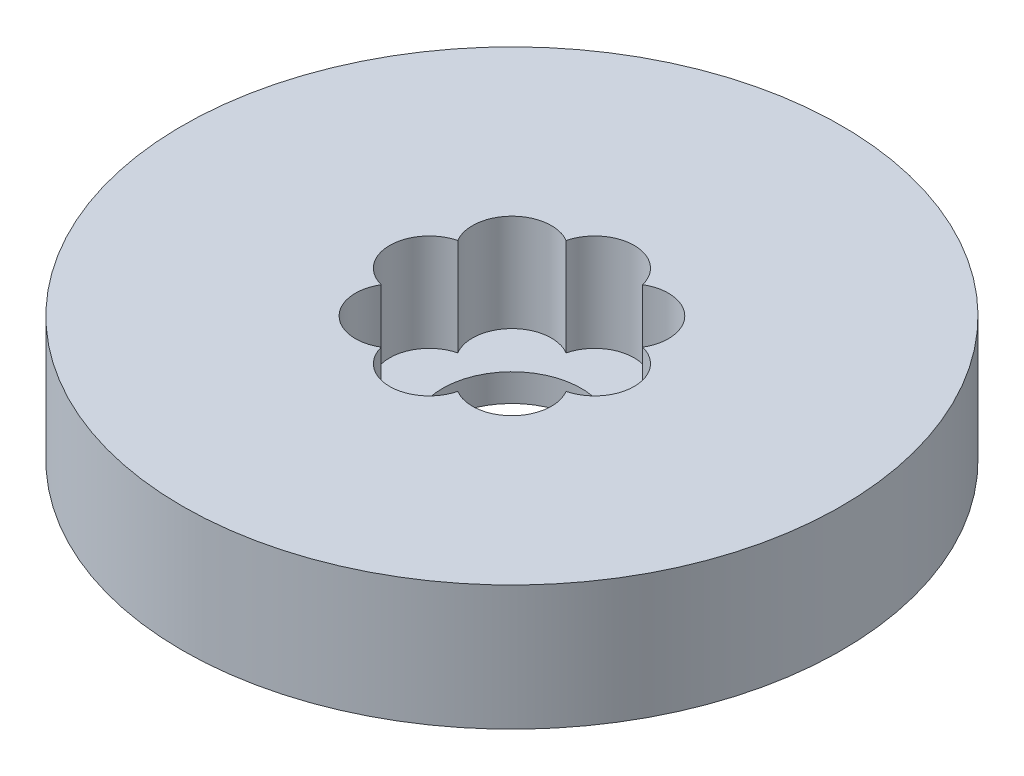
ISO-10303-21;
HEADER;
FILE_DESCRIPTION(('STEP AP214'),'2;1');
FILE_NAME('part.step','',(''),(''),'','','');
FILE_SCHEMA(('AUTOMOTIVE_DESIGN { 1 0 10303 214 1 1 1 1 }'));
ENDSEC;
DATA;
#1=APPLICATION_CONTEXT('core data for automotive mechanical design processes');
#2=APPLICATION_PROTOCOL_DEFINITION('international standard','automotive_design',2000,#1);
#3=PRODUCT_CONTEXT('',#1,'mechanical');
#4=PRODUCT('Part','Part','',(#3));
#5=PRODUCT_RELATED_PRODUCT_CATEGORY('part','',(#4));
#6=PRODUCT_DEFINITION_FORMATION('','',#4);
#7=PRODUCT_DEFINITION_CONTEXT('part definition',#1,'design');
#8=PRODUCT_DEFINITION('design','',#6,#7);
#9=PRODUCT_DEFINITION_SHAPE('','',#8);
#10=(LENGTH_UNIT() NAMED_UNIT(*) SI_UNIT(.MILLI.,.METRE.));
#11=(NAMED_UNIT(*) PLANE_ANGLE_UNIT() SI_UNIT($,.RADIAN.));
#12=(NAMED_UNIT(*) SI_UNIT($,.STERADIAN.) SOLID_ANGLE_UNIT());
#13=UNCERTAINTY_MEASURE_WITH_UNIT(LENGTH_MEASURE(1.E-05),#10,'distance_accuracy_value','');
#14=(GEOMETRIC_REPRESENTATION_CONTEXT(3) GLOBAL_UNCERTAINTY_ASSIGNED_CONTEXT((#13)) GLOBAL_UNIT_ASSIGNED_CONTEXT((#10,
#11,#12)) REPRESENTATION_CONTEXT('',''));
#15=CARTESIAN_POINT('',(0.,0.,0.));
#16=DIRECTION('',(0.,0.,1.));
#17=DIRECTION('',(1.,0.,0.));
#18=AXIS2_PLACEMENT_3D('',#15,#16,#17);
#19=CARTESIAN_POINT('',(0.,18.,0.));
#20=DIRECTION('',(0.,-1.,0.));
#21=DIRECTION('',(0.,0.,-1.));
#22=AXIS2_PLACEMENT_3D('',#19,#20,#21);
#23=CYLINDRICAL_SURFACE('',#22,10.);
#24=CARTESIAN_POINT('',(0.,0.,0.));
#25=DIRECTION('',(0.,1.,0.));
#26=DIRECTION('',(0.,0.,1.));
#27=AXIS2_PLACEMENT_3D('',#24,#25,#26);
#28=CIRCLE('',#27,10.);
#29=CARTESIAN_POINT('',(0.,0.,10.));
#30=VERTEX_POINT('',#29);
#31=EDGE_CURVE('E166',#30,#30,#28,.T.);
#32=ORIENTED_EDGE('',*,*,#31,.F.);
#33=EDGE_LOOP('',(#32));
#34=FACE_BOUND('',#33,.T.);
#35=CARTESIAN_POINT('',(0.,3.96460841904352,0.));
#36=DIRECTION('',(0.,1.,0.));
#37=DIRECTION('',(0.,0.,1.));
#38=AXIS2_PLACEMENT_3D('',#35,#36,#37);
#39=CIRCLE('',#38,10.);
#40=CARTESIAN_POINT('',(0.,3.96460841904352,10.));
#41=VERTEX_POINT('',#40);
#42=EDGE_CURVE('E11',#41,#41,#39,.T.);
#43=ORIENTED_EDGE('',*,*,#42,.T.);
#44=EDGE_LOOP('',(#43));
#45=FACE_BOUND('',#44,.T.);
#46=ADVANCED_FACE('F39',(#34,#45),#23,.F.);
#47=CARTESIAN_POINT('',(0.,18.,0.));
#48=DIRECTION('',(0.,-1.,0.));
#49=DIRECTION('',(0.,0.,-1.));
#50=AXIS2_PLACEMENT_3D('',#47,#48,#49);
#51=CYLINDRICAL_SURFACE('',#50,47.5);
#52=CARTESIAN_POINT('',(0.,18.,0.));
#53=DIRECTION('',(0.,1.,0.));
#54=DIRECTION('',(0.,0.,1.));
#55=AXIS2_PLACEMENT_3D('',#52,#53,#54);
#56=CIRCLE('',#55,47.5);
#57=CARTESIAN_POINT('',(0.,18.,47.5));
#58=VERTEX_POINT('',#57);
#59=EDGE_CURVE('E50',#58,#58,#56,.T.);
#60=ORIENTED_EDGE('',*,*,#59,.F.);
#61=EDGE_LOOP('',(#60));
#62=FACE_BOUND('',#61,.T.);
#63=CARTESIAN_POINT('',(0.,0.,0.));
#64=DIRECTION('',(0.,1.,0.));
#65=DIRECTION('',(0.,0.,1.));
#66=AXIS2_PLACEMENT_3D('',#63,#64,#65);
#67=CIRCLE('',#66,47.5);
#68=CARTESIAN_POINT('',(0.,0.,47.5));
#69=VERTEX_POINT('',#68);
#70=EDGE_CURVE('E173',#69,#69,#67,.T.);
#71=ORIENTED_EDGE('',*,*,#70,.T.);
#72=EDGE_LOOP('',(#71));
#73=FACE_BOUND('',#72,.T.);
#74=ADVANCED_FACE('F41',(#62,#73),#51,.T.);
#75=CARTESIAN_POINT('',(0.,18.,0.));
#76=DIRECTION('',(0.,1.,0.));
#77=DIRECTION('',(0.,0.,1.));
#78=AXIS2_PLACEMENT_3D('',#75,#76,#77);
#79=PLANE('',#78);
#80=CARTESIAN_POINT('',(-8.4312118742269,18.,8.43121187422693));
#81=DIRECTION('',(0.,1.,0.));
#82=DIRECTION('',(0.707106781186549,0.,0.707106781186546));
#83=AXIS2_PLACEMENT_3D('',#80,#81,#82);
#84=CIRCLE('',#83,5.6939499001438);
#85=CARTESIAN_POINT('',(-13.3240819327564,18.,5.51901544271803));
#86=VERTEX_POINT('',#85);
#87=CARTESIAN_POINT('',(-5.51901544271798,18.,13.3240819327564));
#88=VERTEX_POINT('',#87);
#89=EDGE_CURVE('E159',#86,#88,#84,.T.);
#90=ORIENTED_EDGE('',*,*,#89,.F.);
#91=CARTESIAN_POINT('',(-11.9235341797728,18.,0.));
#92=DIRECTION('',(0.,1.,0.));
#93=DIRECTION('',(0.,0.,1.));
#94=AXIS2_PLACEMENT_3D('',#91,#92,#93);
#95=CIRCLE('',#94,5.6939499001438);
#96=CARTESIAN_POINT('',(-13.3240819327566,18.,-5.51901544271799));
#97=VERTEX_POINT('',#96);
#98=EDGE_CURVE('E167',#97,#86,#95,.T.);
#99=ORIENTED_EDGE('',*,*,#98,.F.);
#100=CARTESIAN_POINT('',(-8.43121187422702,18.,-8.43121187422681));
#101=DIRECTION('',(0.,1.,0.));
#102=DIRECTION('',(-0.707106781186539,0.,0.707106781186556));
#103=AXIS2_PLACEMENT_3D('',#100,#101,#102);
#104=CIRCLE('',#103,5.6939499001438);
#105=CARTESIAN_POINT('',(-5.51901544271817,18.,-13.3240819327563));
#106=VERTEX_POINT('',#105);
#107=EDGE_CURVE('E53',#106,#97,#104,.T.);
#108=ORIENTED_EDGE('',*,*,#107,.F.);
#109=CARTESIAN_POINT('',(-1.24892391245205E-13,18.,-11.9235341797728));
#110=DIRECTION('',(0.,1.,0.));
#111=DIRECTION('',(-1.,0.,0.));
#112=AXIS2_PLACEMENT_3D('',#109,#110,#111);
#113=CIRCLE('',#112,5.6939499001438);
#114=CARTESIAN_POINT('',(5.51901544271789,18.,-13.3240819327564));
#115=VERTEX_POINT('',#114);
#116=EDGE_CURVE('E117',#115,#106,#113,.T.);
#117=ORIENTED_EDGE('',*,*,#116,.F.);
#118=CARTESIAN_POINT('',(8.43121187422684,18.,-8.43121187422699));
#119=DIRECTION('',(0.,1.,0.));
#120=DIRECTION('',(-0.707106781186554,0.,-0.707106781186541));
#121=AXIS2_PLACEMENT_3D('',#118,#119,#120);
#122=CIRCLE('',#121,5.6939499001438);
#123=CARTESIAN_POINT('',(13.3240819327563,18.,-5.51901544271805));
#124=VERTEX_POINT('',#123);
#125=EDGE_CURVE('E120',#124,#115,#122,.T.);
#126=ORIENTED_EDGE('',*,*,#125,.F.);
#127=CARTESIAN_POINT('',(11.9235341797728,18.,0.));
#128=DIRECTION('',(0.,1.,0.));
#129=DIRECTION('',(0.,0.,-1.));
#130=AXIS2_PLACEMENT_3D('',#127,#128,#129);
#131=CIRCLE('',#130,5.6939499001438);
#132=CARTESIAN_POINT('',(13.3240819327565,18.,5.51901544271801));
#133=VERTEX_POINT('',#132);
#134=EDGE_CURVE('E136',#133,#124,#131,.T.);
#135=ORIENTED_EDGE('',*,*,#134,.F.);
#136=CARTESIAN_POINT('',(8.43121187422696,18.,8.43121187422687));
#137=DIRECTION('',(0.,1.,0.));
#138=DIRECTION('',(0.707106781186544,0.,-0.707106781186551));
#139=AXIS2_PLACEMENT_3D('',#136,#137,#138);
#140=CIRCLE('',#139,5.6939499001438);
#141=CARTESIAN_POINT('',(5.51901544271808,18.,13.3240819327564));
#142=VERTEX_POINT('',#141);
#143=EDGE_CURVE('E138',#142,#133,#140,.T.);
#144=ORIENTED_EDGE('',*,*,#143,.F.);
#145=CARTESIAN_POINT('',(0.,18.,11.9235341797728));
#146=DIRECTION('',(0.,1.,0.));
#147=DIRECTION('',(1.,0.,0.));
#148=AXIS2_PLACEMENT_3D('',#145,#146,#147);
#149=CIRCLE('',#148,5.6939499001438);
#150=EDGE_CURVE('E146',#88,#142,#149,.T.);
#151=ORIENTED_EDGE('',*,*,#150,.F.);
#152=EDGE_LOOP('',(#90,#99,#108,#117,#126,#135,#144,#151));
#153=FACE_BOUND('',#152,.T.);
#154=ORIENTED_EDGE('',*,*,#59,.T.);
#155=EDGE_LOOP('',(#154));
#156=FACE_BOUND('',#155,.T.);
#157=ADVANCED_FACE('F181',(#153,#156),#79,.T.);
#158=CARTESIAN_POINT('',(0.,0.,0.));
#159=DIRECTION('',(0.,1.,0.));
#160=DIRECTION('',(0.,0.,1.));
#161=AXIS2_PLACEMENT_3D('',#158,#159,#160);
#162=PLANE('',#161);
#163=ORIENTED_EDGE('',*,*,#31,.T.);
#164=EDGE_LOOP('',(#163));
#165=FACE_BOUND('',#164,.T.);
#166=ORIENTED_EDGE('',*,*,#70,.F.);
#167=EDGE_LOOP('',(#166));
#168=FACE_BOUND('',#167,.T.);
#169=ADVANCED_FACE('F179',(#165,#168),#162,.F.);
#170=CARTESIAN_POINT('',(-11.9235341797728,3.96460841904352,0.));
#171=DIRECTION('',(0.,1.,0.));
#172=DIRECTION('',(0.,0.,1.));
#173=AXIS2_PLACEMENT_3D('',#170,#171,#172);
#174=CYLINDRICAL_SURFACE('',#173,5.6939499001438);
#175=ORIENTED_EDGE('',*,*,#98,.T.);
#176=DIRECTION('',(0.,1.,0.));
#177=VECTOR('',#176,1.);
#178=CARTESIAN_POINT('',(-13.3240819327564,10.9823042095218,5.51901544271803));
#179=LINE('',#178,#177);
#180=CARTESIAN_POINT('',(-13.3240819327564,3.96460841904352,5.51901544271803));
#181=VERTEX_POINT('',#180);
#182=EDGE_CURVE('E65',#86,#181,#179,.F.);
#183=ORIENTED_EDGE('',*,*,#182,.T.);
#184=CARTESIAN_POINT('',(-11.9235341797728,3.96460841904352,0.));
#185=DIRECTION('',(0.,1.,0.));
#186=DIRECTION('',(0.,0.,1.));
#187=AXIS2_PLACEMENT_3D('',#184,#185,#186);
#188=CIRCLE('',#187,5.6939499001438);
#189=CARTESIAN_POINT('',(-13.3240819327566,3.96460841904352,-5.51901544271799));
#190=VERTEX_POINT('',#189);
#191=EDGE_CURVE('E170',#190,#181,#188,.T.);
#192=ORIENTED_EDGE('',*,*,#191,.F.);
#193=DIRECTION('',(0.,1.,0.));
#194=VECTOR('',#193,1.);
#195=CARTESIAN_POINT('',(-13.3240819327566,10.9823042095218,-5.51901544271799));
#196=LINE('',#195,#194);
#197=EDGE_CURVE('E124',#190,#97,#196,.T.);
#198=ORIENTED_EDGE('',*,*,#197,.T.);
#199=EDGE_LOOP('',(#175,#183,#192,#198));
#200=FACE_BOUND('',#199,.T.);
#201=ADVANCED_FACE('F185',(#200),#174,.F.);
#202=CARTESIAN_POINT('',(-11.9235341797728,3.96460841904352,0.));
#203=DIRECTION('',(0.,1.,0.));
#204=DIRECTION('',(0.,0.,1.));
#205=AXIS2_PLACEMENT_3D('',#202,#203,#204);
#206=PLANE('',#205);
#207=ORIENTED_EDGE('',*,*,#191,.T.);
#208=CARTESIAN_POINT('',(-8.4312118742269,3.96460841904352,8.43121187422693));
#209=DIRECTION('',(0.,1.,0.));
#210=DIRECTION('',(0.707106781186549,0.,0.707106781186546));
#211=AXIS2_PLACEMENT_3D('',#208,#209,#210);
#212=CIRCLE('',#211,5.6939499001438);
#213=CARTESIAN_POINT('',(-5.51901544271799,3.96460841904352,13.3240819327564));
#214=VERTEX_POINT('',#213);
#215=EDGE_CURVE('E161',#181,#214,#212,.T.);
#216=ORIENTED_EDGE('',*,*,#215,.T.);
#217=CARTESIAN_POINT('',(0.,3.96460841904352,11.9235341797728));
#218=DIRECTION('',(0.,1.,0.));
#219=DIRECTION('',(1.,0.,0.));
#220=AXIS2_PLACEMENT_3D('',#217,#218,#219);
#221=CIRCLE('',#220,5.6939499001438);
#222=CARTESIAN_POINT('',(5.51901544271808,3.96460841904352,13.3240819327564));
#223=VERTEX_POINT('',#222);
#224=EDGE_CURVE('E149',#214,#223,#221,.T.);
#225=ORIENTED_EDGE('',*,*,#224,.T.);
#226=CARTESIAN_POINT('',(8.43121187422696,3.96460841904352,8.43121187422687));
#227=DIRECTION('',(0.,1.,0.));
#228=DIRECTION('',(0.707106781186544,0.,-0.707106781186551));
#229=AXIS2_PLACEMENT_3D('',#226,#227,#228);
#230=CIRCLE('',#229,5.6939499001438);
#231=CARTESIAN_POINT('',(13.3240819327565,3.96460841904352,5.51901544271801));
#232=VERTEX_POINT('',#231);
#233=EDGE_CURVE('E143',#223,#232,#230,.T.);
#234=ORIENTED_EDGE('',*,*,#233,.T.);
#235=CARTESIAN_POINT('',(11.9235341797728,3.96460841904352,0.));
#236=DIRECTION('',(0.,1.,0.));
#237=DIRECTION('',(0.,0.,-1.));
#238=AXIS2_PLACEMENT_3D('',#235,#236,#237);
#239=CIRCLE('',#238,5.6939499001438);
#240=CARTESIAN_POINT('',(13.3240819327563,3.96460841904352,-5.51901544271805));
#241=VERTEX_POINT('',#240);
#242=EDGE_CURVE('E140',#232,#241,#239,.T.);
#243=ORIENTED_EDGE('',*,*,#242,.T.);
#244=CARTESIAN_POINT('',(8.43121187422684,3.96460841904352,-8.43121187422699));
#245=DIRECTION('',(0.,1.,0.));
#246=DIRECTION('',(-0.707106781186554,0.,-0.707106781186541));
#247=AXIS2_PLACEMENT_3D('',#244,#245,#246);
#248=CIRCLE('',#247,5.6939499001438);
#249=CARTESIAN_POINT('',(5.51901544271789,3.96460841904352,-13.3240819327564));
#250=VERTEX_POINT('',#249);
#251=EDGE_CURVE('E111',#241,#250,#248,.T.);
#252=ORIENTED_EDGE('',*,*,#251,.T.);
#253=CARTESIAN_POINT('',(-1.24892391245205E-13,3.96460841904352,-11.9235341797728));
#254=DIRECTION('',(0.,1.,0.));
#255=DIRECTION('',(-1.,0.,0.));
#256=AXIS2_PLACEMENT_3D('',#253,#254,#255);
#257=CIRCLE('',#256,5.6939499001438);
#258=CARTESIAN_POINT('',(-5.51901544271817,3.96460841904352,-13.3240819327563));
#259=VERTEX_POINT('',#258);
#260=EDGE_CURVE('E104',#250,#259,#257,.T.);
#261=ORIENTED_EDGE('',*,*,#260,.T.);
#262=CARTESIAN_POINT('',(-8.43121187422702,3.96460841904352,-8.43121187422681));
#263=DIRECTION('',(0.,1.,0.));
#264=DIRECTION('',(-0.707106781186539,0.,0.707106781186556));
#265=AXIS2_PLACEMENT_3D('',#262,#263,#264);
#266=CIRCLE('',#265,5.6939499001438);
#267=EDGE_CURVE('E112',#259,#190,#266,.T.);
#268=ORIENTED_EDGE('',*,*,#267,.T.);
#269=EDGE_LOOP('',(#207,#216,#225,#234,#243,#252,#261,#268));
#270=FACE_BOUND('',#269,.T.);
#271=ORIENTED_EDGE('',*,*,#42,.F.);
#272=EDGE_LOOP('',(#271));
#273=FACE_BOUND('',#272,.T.);
#274=ADVANCED_FACE('F107',(#270,#273),#206,.T.);
#275=CARTESIAN_POINT('',(-8.4312118742269,3.96460841904352,8.43121187422693));
#276=DIRECTION('',(0.,1.,0.));
#277=DIRECTION('',(0.,0.,1.));
#278=AXIS2_PLACEMENT_3D('',#275,#276,#277);
#279=CYLINDRICAL_SURFACE('',#278,5.6939499001438);
#280=ORIENTED_EDGE('',*,*,#89,.T.);
#281=DIRECTION('',(0.,1.,0.));
#282=VECTOR('',#281,1.);
#283=CARTESIAN_POINT('',(-5.51901544271799,10.9823042095218,13.3240819327564));
#284=LINE('',#283,#282);
#285=EDGE_CURVE('E160',#88,#214,#284,.F.);
#286=ORIENTED_EDGE('',*,*,#285,.T.);
#287=ORIENTED_EDGE('',*,*,#215,.F.);
#288=ORIENTED_EDGE('',*,*,#182,.F.);
#289=EDGE_LOOP('',(#280,#286,#287,#288));
#290=FACE_BOUND('',#289,.T.);
#291=ADVANCED_FACE('F202',(#290),#279,.F.);
#292=CARTESIAN_POINT('',(-8.43121187422702,3.96460841904352,-8.43121187422681));
#293=DIRECTION('',(0.,1.,0.));
#294=DIRECTION('',(0.,0.,1.));
#295=AXIS2_PLACEMENT_3D('',#292,#293,#294);
#296=CYLINDRICAL_SURFACE('',#295,5.6939499001438);
#297=ORIENTED_EDGE('',*,*,#267,.F.);
#298=DIRECTION('',(0.,1.,0.));
#299=VECTOR('',#298,1.);
#300=CARTESIAN_POINT('',(-5.51901544271817,10.9823042095218,-13.3240819327563));
#301=LINE('',#300,#299);
#302=EDGE_CURVE('E119',#106,#259,#301,.F.);
#303=ORIENTED_EDGE('',*,*,#302,.F.);
#304=ORIENTED_EDGE('',*,*,#107,.T.);
#305=ORIENTED_EDGE('',*,*,#197,.F.);
#306=EDGE_LOOP('',(#297,#303,#304,#305));
#307=FACE_BOUND('',#306,.T.);
#308=ADVANCED_FACE('F123',(#307),#296,.F.);
#309=CARTESIAN_POINT('',(0.,3.96460841904352,11.9235341797728));
#310=DIRECTION('',(0.,1.,0.));
#311=DIRECTION('',(0.,0.,1.));
#312=AXIS2_PLACEMENT_3D('',#309,#310,#311);
#313=CYLINDRICAL_SURFACE('',#312,5.6939499001438);
#314=ORIENTED_EDGE('',*,*,#150,.T.);
#315=DIRECTION('',(0.,1.,0.));
#316=VECTOR('',#315,1.);
#317=CARTESIAN_POINT('',(5.51901544271808,10.9823042095218,13.3240819327564));
#318=LINE('',#317,#316);
#319=EDGE_CURVE('E141',#142,#223,#318,.F.);
#320=ORIENTED_EDGE('',*,*,#319,.T.);
#321=ORIENTED_EDGE('',*,*,#224,.F.);
#322=ORIENTED_EDGE('',*,*,#285,.F.);
#323=EDGE_LOOP('',(#314,#320,#321,#322));
#324=FACE_BOUND('',#323,.T.);
#325=ADVANCED_FACE('F208',(#324),#313,.F.);
#326=CARTESIAN_POINT('',(8.43121187422696,3.96460841904352,8.43121187422687));
#327=DIRECTION('',(0.,1.,0.));
#328=DIRECTION('',(0.,0.,1.));
#329=AXIS2_PLACEMENT_3D('',#326,#327,#328);
#330=CYLINDRICAL_SURFACE('',#329,5.6939499001438);
#331=DIRECTION('',(0.,1.,0.));
#332=VECTOR('',#331,1.);
#333=CARTESIAN_POINT('',(13.3240819327565,10.9823042095218,5.51901544271801));
#334=LINE('',#333,#332);
#335=EDGE_CURVE('E151',#133,#232,#334,.F.);
#336=ORIENTED_EDGE('',*,*,#335,.T.);
#337=ORIENTED_EDGE('',*,*,#233,.F.);
#338=ORIENTED_EDGE('',*,*,#319,.F.);
#339=ORIENTED_EDGE('',*,*,#143,.T.);
#340=EDGE_LOOP('',(#336,#337,#338,#339));
#341=FACE_BOUND('',#340,.T.);
#342=ADVANCED_FACE('F211',(#341),#330,.F.);
#343=CARTESIAN_POINT('',(11.9235341797728,3.96460841904352,0.));
#344=DIRECTION('',(0.,1.,0.));
#345=DIRECTION('',(0.,0.,1.));
#346=AXIS2_PLACEMENT_3D('',#343,#344,#345);
#347=CYLINDRICAL_SURFACE('',#346,5.6939499001438);
#348=ORIENTED_EDGE('',*,*,#134,.T.);
#349=DIRECTION('',(0.,1.,0.));
#350=VECTOR('',#349,1.);
#351=CARTESIAN_POINT('',(13.3240819327563,10.9823042095218,-5.51901544271805));
#352=LINE('',#351,#350);
#353=EDGE_CURVE('E131',#124,#241,#352,.F.);
#354=ORIENTED_EDGE('',*,*,#353,.T.);
#355=ORIENTED_EDGE('',*,*,#242,.F.);
#356=ORIENTED_EDGE('',*,*,#335,.F.);
#357=EDGE_LOOP('',(#348,#354,#355,#356));
#358=FACE_BOUND('',#357,.T.);
#359=ADVANCED_FACE('F214',(#358),#347,.F.);
#360=CARTESIAN_POINT('',(8.43121187422684,3.96460841904352,-8.43121187422699));
#361=DIRECTION('',(0.,1.,0.));
#362=DIRECTION('',(0.,0.,1.));
#363=AXIS2_PLACEMENT_3D('',#360,#361,#362);
#364=CYLINDRICAL_SURFACE('',#363,5.6939499001438);
#365=DIRECTION('',(0.,1.,0.));
#366=VECTOR('',#365,1.);
#367=CARTESIAN_POINT('',(5.51901544271789,10.9823042095218,-13.3240819327564));
#368=LINE('',#367,#366);
#369=EDGE_CURVE('E154',#115,#250,#368,.F.);
#370=ORIENTED_EDGE('',*,*,#369,.T.);
#371=ORIENTED_EDGE('',*,*,#251,.F.);
#372=ORIENTED_EDGE('',*,*,#353,.F.);
#373=ORIENTED_EDGE('',*,*,#125,.T.);
#374=EDGE_LOOP('',(#370,#371,#372,#373));
#375=FACE_BOUND('',#374,.T.);
#376=ADVANCED_FACE('F218',(#375),#364,.F.);
#377=CARTESIAN_POINT('',(-1.24892391245205E-13,3.96460841904352,-11.9235341797728));
#378=DIRECTION('',(0.,1.,0.));
#379=DIRECTION('',(0.,0.,1.));
#380=AXIS2_PLACEMENT_3D('',#377,#378,#379);
#381=CYLINDRICAL_SURFACE('',#380,5.6939499001438);
#382=ORIENTED_EDGE('',*,*,#116,.T.);
#383=ORIENTED_EDGE('',*,*,#302,.T.);
#384=ORIENTED_EDGE('',*,*,#260,.F.);
#385=ORIENTED_EDGE('',*,*,#369,.F.);
#386=EDGE_LOOP('',(#382,#383,#384,#385));
#387=FACE_BOUND('',#386,.T.);
#388=ADVANCED_FACE('F121',(#387),#381,.F.);
#389=CLOSED_SHELL('',(#46,#74,#157,#169,#201,#274,#291,#308,#325,#342,#359,#376,#388));
#390=MANIFOLD_SOLID_BREP('B2',#389);
#391=ADVANCED_BREP_SHAPE_REPRESENTATION('',(#18,#390),#14);
#392=SHAPE_DEFINITION_REPRESENTATION(#9,#391);
ENDSEC;
END-ISO-10303-21;
